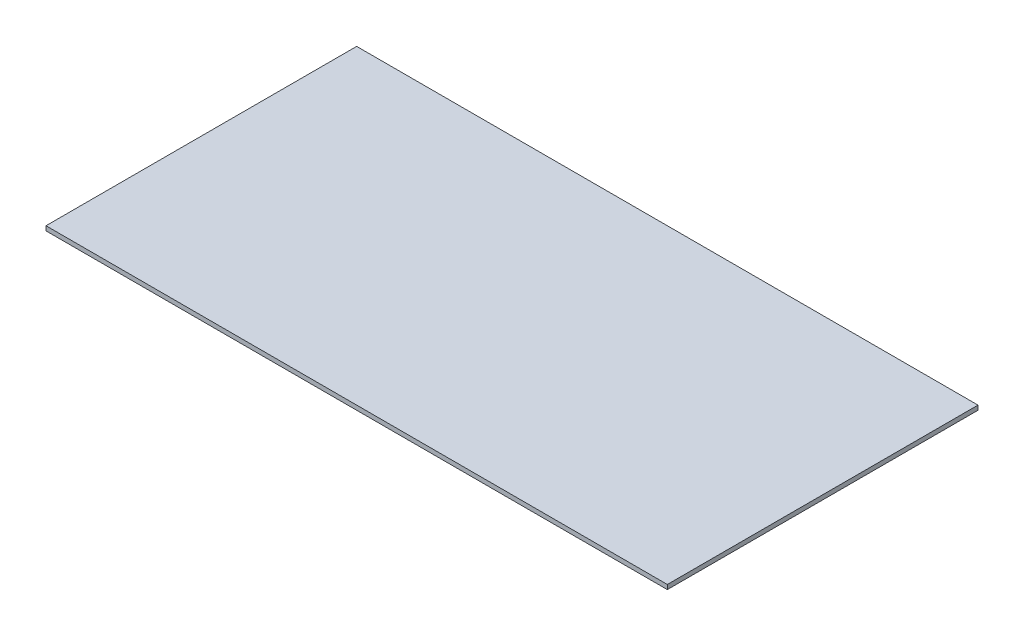
ISO-10303-21;
HEADER;
FILE_DESCRIPTION(('STEP AP214'),'2;1');
FILE_NAME('part.step','',(''),(''),'','','');
FILE_SCHEMA(('AUTOMOTIVE_DESIGN { 1 0 10303 214 1 1 1 1 }'));
ENDSEC;
DATA;
#1=APPLICATION_CONTEXT('core data for automotive mechanical design processes');
#2=APPLICATION_PROTOCOL_DEFINITION('international standard','automotive_design',2000,#1);
#3=PRODUCT_CONTEXT('',#1,'mechanical');
#4=PRODUCT('Part','Part','',(#3));
#5=PRODUCT_RELATED_PRODUCT_CATEGORY('part','',(#4));
#6=PRODUCT_DEFINITION_FORMATION('','',#4);
#7=PRODUCT_DEFINITION_CONTEXT('part definition',#1,'design');
#8=PRODUCT_DEFINITION('design','',#6,#7);
#9=PRODUCT_DEFINITION_SHAPE('','',#8);
#10=(LENGTH_UNIT() NAMED_UNIT(*) SI_UNIT(.MILLI.,.METRE.));
#11=(NAMED_UNIT(*) PLANE_ANGLE_UNIT() SI_UNIT($,.RADIAN.));
#12=(NAMED_UNIT(*) SI_UNIT($,.STERADIAN.) SOLID_ANGLE_UNIT());
#13=UNCERTAINTY_MEASURE_WITH_UNIT(LENGTH_MEASURE(1.E-05),#10,'distance_accuracy_value','');
#14=(GEOMETRIC_REPRESENTATION_CONTEXT(3) GLOBAL_UNCERTAINTY_ASSIGNED_CONTEXT((#13)) GLOBAL_UNIT_ASSIGNED_CONTEXT((#10,
#11,#12)) REPRESENTATION_CONTEXT('',''));
#15=CARTESIAN_POINT('',(0.,0.,0.));
#16=DIRECTION('',(0.,0.,1.));
#17=DIRECTION('',(1.,0.,0.));
#18=AXIS2_PLACEMENT_3D('',#15,#16,#17);
#19=CARTESIAN_POINT('',(0.,0.36,0.));
#20=DIRECTION('',(1.,0.,0.));
#21=DIRECTION('',(0.,0.,-1.));
#22=AXIS2_PLACEMENT_3D('',#19,#20,#21);
#23=PLANE('',#22);
#24=DIRECTION('',(0.,0.,1.));
#25=VECTOR('',#24,1.);
#26=CARTESIAN_POINT('',(0.,0.,0.));
#27=LINE('',#26,#25);
#28=CARTESIAN_POINT('',(0.,0.,-25.));
#29=VERTEX_POINT('',#28);
#30=CARTESIAN_POINT('',(0.,0.,0.));
#31=VERTEX_POINT('',#30);
#32=EDGE_CURVE('E96',#29,#31,#27,.T.);
#33=ORIENTED_EDGE('',*,*,#32,.T.);
#34=DIRECTION('',(0.,-1.,0.));
#35=VECTOR('',#34,1.);
#36=CARTESIAN_POINT('',(0.,0.36,0.));
#37=LINE('',#36,#35);
#38=CARTESIAN_POINT('',(0.,0.36,0.));
#39=VERTEX_POINT('',#38);
#40=EDGE_CURVE('E11',#39,#31,#37,.T.);
#41=ORIENTED_EDGE('',*,*,#40,.F.);
#42=DIRECTION('',(0.,0.,1.));
#43=VECTOR('',#42,1.);
#44=CARTESIAN_POINT('',(0.,0.36,0.));
#45=LINE('',#44,#43);
#46=CARTESIAN_POINT('',(0.,0.36,-25.));
#47=VERTEX_POINT('',#46);
#48=EDGE_CURVE('E84',#47,#39,#45,.T.);
#49=ORIENTED_EDGE('',*,*,#48,.F.);
#50=DIRECTION('',(0.,-1.,0.));
#51=VECTOR('',#50,1.);
#52=CARTESIAN_POINT('',(0.,0.36,-25.));
#53=LINE('',#52,#51);
#54=EDGE_CURVE('E92',#47,#29,#53,.T.);
#55=ORIENTED_EDGE('',*,*,#54,.T.);
#56=EDGE_LOOP('',(#33,#41,#49,#55));
#57=FACE_BOUND('',#56,.T.);
#58=ADVANCED_FACE('F33',(#57),#23,.F.);
#59=CARTESIAN_POINT('',(0.,0.36,0.));
#60=DIRECTION('',(0.,0.,-1.));
#61=DIRECTION('',(-1.,0.,0.));
#62=AXIS2_PLACEMENT_3D('',#59,#60,#61);
#63=PLANE('',#62);
#64=DIRECTION('',(1.,0.,0.));
#65=VECTOR('',#64,1.);
#66=CARTESIAN_POINT('',(0.,0.,0.));
#67=LINE('',#66,#65);
#68=CARTESIAN_POINT('',(50.,0.,0.));
#69=VERTEX_POINT('',#68);
#70=EDGE_CURVE('E88',#31,#69,#67,.T.);
#71=ORIENTED_EDGE('',*,*,#70,.T.);
#72=DIRECTION('',(0.,-1.,0.));
#73=VECTOR('',#72,1.);
#74=CARTESIAN_POINT('',(50.,0.36,0.));
#75=LINE('',#74,#73);
#76=CARTESIAN_POINT('',(50.,0.36,0.));
#77=VERTEX_POINT('',#76);
#78=EDGE_CURVE('E41',#77,#69,#75,.T.);
#79=ORIENTED_EDGE('',*,*,#78,.F.);
#80=DIRECTION('',(1.,0.,0.));
#81=VECTOR('',#80,1.);
#82=CARTESIAN_POINT('',(0.,0.36,0.));
#83=LINE('',#82,#81);
#84=EDGE_CURVE('E79',#39,#77,#83,.T.);
#85=ORIENTED_EDGE('',*,*,#84,.F.);
#86=ORIENTED_EDGE('',*,*,#40,.T.);
#87=EDGE_LOOP('',(#71,#79,#85,#86));
#88=FACE_BOUND('',#87,.T.);
#89=ADVANCED_FACE('F87',(#88),#63,.F.);
#90=CARTESIAN_POINT('',(50.,0.36,0.));
#91=DIRECTION('',(-1.,0.,0.));
#92=DIRECTION('',(0.,0.,1.));
#93=AXIS2_PLACEMENT_3D('',#90,#91,#92);
#94=PLANE('',#93);
#95=DIRECTION('',(0.,0.,-1.));
#96=VECTOR('',#95,1.);
#97=CARTESIAN_POINT('',(50.,0.,0.));
#98=LINE('',#97,#96);
#99=CARTESIAN_POINT('',(50.,0.,-25.));
#100=VERTEX_POINT('',#99);
#101=EDGE_CURVE('E66',#69,#100,#98,.T.);
#102=ORIENTED_EDGE('',*,*,#101,.T.);
#103=DIRECTION('',(0.,-1.,0.));
#104=VECTOR('',#103,1.);
#105=CARTESIAN_POINT('',(50.,0.36,-25.));
#106=LINE('',#105,#104);
#107=CARTESIAN_POINT('',(50.,0.36,-25.));
#108=VERTEX_POINT('',#107);
#109=EDGE_CURVE('E89',#108,#100,#106,.T.);
#110=ORIENTED_EDGE('',*,*,#109,.F.);
#111=DIRECTION('',(0.,0.,-1.));
#112=VECTOR('',#111,1.);
#113=CARTESIAN_POINT('',(50.,0.36,0.));
#114=LINE('',#113,#112);
#115=EDGE_CURVE('E82',#77,#108,#114,.T.);
#116=ORIENTED_EDGE('',*,*,#115,.F.);
#117=ORIENTED_EDGE('',*,*,#78,.T.);
#118=EDGE_LOOP('',(#102,#110,#116,#117));
#119=FACE_BOUND('',#118,.T.);
#120=ADVANCED_FACE('F90',(#119),#94,.F.);
#121=CARTESIAN_POINT('',(0.,0.36,-25.));
#122=DIRECTION('',(0.,0.,1.));
#123=DIRECTION('',(1.,0.,0.));
#124=AXIS2_PLACEMENT_3D('',#121,#122,#123);
#125=PLANE('',#124);
#126=DIRECTION('',(-1.,0.,0.));
#127=VECTOR('',#126,1.);
#128=CARTESIAN_POINT('',(0.,0.,-25.));
#129=LINE('',#128,#127);
#130=EDGE_CURVE('E72',#100,#29,#129,.T.);
#131=ORIENTED_EDGE('',*,*,#130,.T.);
#132=ORIENTED_EDGE('',*,*,#54,.F.);
#133=DIRECTION('',(-1.,0.,0.));
#134=VECTOR('',#133,1.);
#135=CARTESIAN_POINT('',(0.,0.36,-25.));
#136=LINE('',#135,#134);
#137=EDGE_CURVE('E49',#108,#47,#136,.T.);
#138=ORIENTED_EDGE('',*,*,#137,.F.);
#139=ORIENTED_EDGE('',*,*,#109,.T.);
#140=EDGE_LOOP('',(#131,#132,#138,#139));
#141=FACE_BOUND('',#140,.T.);
#142=ADVANCED_FACE('F103',(#141),#125,.F.);
#143=CARTESIAN_POINT('',(0.,0.36,0.));
#144=DIRECTION('',(0.,-1.,0.));
#145=DIRECTION('',(0.,0.,-1.));
#146=AXIS2_PLACEMENT_3D('',#143,#144,#145);
#147=PLANE('',#146);
#148=ORIENTED_EDGE('',*,*,#48,.T.);
#149=ORIENTED_EDGE('',*,*,#84,.T.);
#150=ORIENTED_EDGE('',*,*,#115,.T.);
#151=ORIENTED_EDGE('',*,*,#137,.T.);
#152=EDGE_LOOP('',(#148,#149,#150,#151));
#153=FACE_BOUND('',#152,.T.);
#154=ADVANCED_FACE('F80',(#153),#147,.F.);
#155=CARTESIAN_POINT('',(0.,0.,0.));
#156=DIRECTION('',(0.,-1.,0.));
#157=DIRECTION('',(0.,0.,-1.));
#158=AXIS2_PLACEMENT_3D('',#155,#156,#157);
#159=PLANE('',#158);
#160=ORIENTED_EDGE('',*,*,#32,.F.);
#161=ORIENTED_EDGE('',*,*,#130,.F.);
#162=ORIENTED_EDGE('',*,*,#101,.F.);
#163=ORIENTED_EDGE('',*,*,#70,.F.);
#164=EDGE_LOOP('',(#160,#161,#162,#163));
#165=FACE_BOUND('',#164,.T.);
#166=ADVANCED_FACE('F106',(#165),#159,.T.);
#167=CLOSED_SHELL('',(#58,#89,#120,#142,#154,#166));
#168=MANIFOLD_SOLID_BREP('B2',#167);
#169=ADVANCED_BREP_SHAPE_REPRESENTATION('',(#18,#168),#14);
#170=SHAPE_DEFINITION_REPRESENTATION(#9,#169);
ENDSEC;
END-ISO-10303-21;
